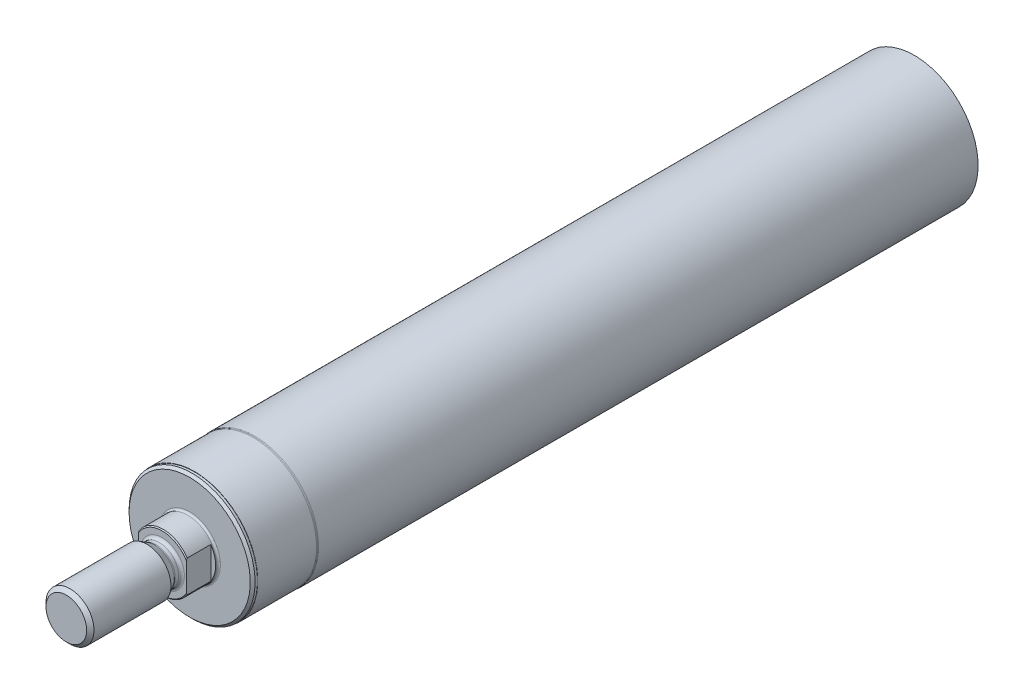
ISO-10303-21;
HEADER;
FILE_DESCRIPTION(('STEP AP214'),'2;1');
FILE_NAME('part.step','',(''),(''),'','','');
FILE_SCHEMA(('AUTOMOTIVE_DESIGN { 1 0 10303 214 1 1 1 1 }'));
ENDSEC;
DATA;
#1=APPLICATION_CONTEXT('core data for automotive mechanical design processes');
#2=APPLICATION_PROTOCOL_DEFINITION('international standard','automotive_design',2000,#1);
#3=PRODUCT_CONTEXT('',#1,'mechanical');
#4=PRODUCT('Part','Part','',(#3));
#5=PRODUCT_RELATED_PRODUCT_CATEGORY('part','',(#4));
#6=PRODUCT_DEFINITION_FORMATION('','',#4);
#7=PRODUCT_DEFINITION_CONTEXT('part definition',#1,'design');
#8=PRODUCT_DEFINITION('design','',#6,#7);
#9=PRODUCT_DEFINITION_SHAPE('','',#8);
#10=(LENGTH_UNIT() NAMED_UNIT(*) SI_UNIT(.MILLI.,.METRE.));
#11=(NAMED_UNIT(*) PLANE_ANGLE_UNIT() SI_UNIT($,.RADIAN.));
#12=(NAMED_UNIT(*) SI_UNIT($,.STERADIAN.) SOLID_ANGLE_UNIT());
#13=UNCERTAINTY_MEASURE_WITH_UNIT(LENGTH_MEASURE(1.E-05),#10,'distance_accuracy_value','');
#14=(GEOMETRIC_REPRESENTATION_CONTEXT(3) GLOBAL_UNCERTAINTY_ASSIGNED_CONTEXT((#13)) GLOBAL_UNIT_ASSIGNED_CONTEXT((#10,
#11,#12)) REPRESENTATION_CONTEXT('',''));
#15=CARTESIAN_POINT('',(0.,0.,0.));
#16=DIRECTION('',(0.,0.,1.));
#17=DIRECTION('',(1.,0.,0.));
#18=AXIS2_PLACEMENT_3D('',#15,#16,#17);
#19=CARTESIAN_POINT('',(0.,4.6,5.7));
#20=DIRECTION('',(0.,0.,-1.));
#21=DIRECTION('',(-1.,0.,0.));
#22=AXIS2_PLACEMENT_3D('',#19,#20,#21);
#23=PLANE('',#22);
#24=CARTESIAN_POINT('',(0.,0.,5.7));
#25=DIRECTION('',(0.,0.,-1.));
#26=DIRECTION('',(-0.862068965517242,0.506790981265484,0.));
#27=AXIS2_PLACEMENT_3D('',#24,#25,#26);
#28=CIRCLE('',#27,5.8);
#29=CARTESIAN_POINT('',(-5.,2.93938769133981,5.7));
#30=VERTEX_POINT('',#29);
#31=CARTESIAN_POINT('',(5.,2.93938769133981,5.7));
#32=VERTEX_POINT('',#31);
#33=EDGE_CURVE('E82',#30,#32,#28,.T.);
#34=ORIENTED_EDGE('',*,*,#33,.F.);
#35=DIRECTION('',(0.,-1.,0.));
#36=VECTOR('',#35,1.);
#37=CARTESIAN_POINT('',(-5.,2.93938769133981,5.7));
#38=LINE('',#37,#36);
#39=CARTESIAN_POINT('',(-5.,-2.93938769133981,5.7));
#40=VERTEX_POINT('',#39);
#41=EDGE_CURVE('E68',#30,#40,#38,.T.);
#42=ORIENTED_EDGE('',*,*,#41,.T.);
#43=CARTESIAN_POINT('',(0.,0.,5.7));
#44=DIRECTION('',(0.,0.,-1.));
#45=DIRECTION('',(0.862068965517242,-0.506790981265484,0.));
#46=AXIS2_PLACEMENT_3D('',#43,#44,#45);
#47=CIRCLE('',#46,5.8);
#48=CARTESIAN_POINT('',(5.,-2.93938769133981,5.7));
#49=VERTEX_POINT('',#48);
#50=EDGE_CURVE('E81',#49,#40,#47,.T.);
#51=ORIENTED_EDGE('',*,*,#50,.F.);
#52=DIRECTION('',(0.,1.,0.));
#53=VECTOR('',#52,1.);
#54=CARTESIAN_POINT('',(5.,-2.93938769133981,5.7));
#55=LINE('',#54,#53);
#56=EDGE_CURVE('E96',#49,#32,#55,.T.);
#57=ORIENTED_EDGE('',*,*,#56,.T.);
#58=EDGE_LOOP('',(#34,#42,#51,#57));
#59=FACE_BOUND('',#58,.T.);
#60=CARTESIAN_POINT('',(0.,0.,5.7));
#61=DIRECTION('',(0.,0.,-1.));
#62=DIRECTION('',(-1.,0.,0.));
#63=AXIS2_PLACEMENT_3D('',#60,#61,#62);
#64=CIRCLE('',#63,4.6000000000001);
#65=CARTESIAN_POINT('',(-4.6000000000001,0.,5.7));
#66=VERTEX_POINT('',#65);
#67=EDGE_CURVE('E107',#66,#66,#64,.T.);
#68=ORIENTED_EDGE('',*,*,#67,.T.);
#69=EDGE_LOOP('',(#68));
#70=FACE_BOUND('',#69,.T.);
#71=ADVANCED_FACE('F17',(#59,#70),#23,.F.);
#72=CARTESIAN_POINT('',(0.,0.,5.7));
#73=DIRECTION('',(0.,0.,-1.));
#74=DIRECTION('',(-1.,0.,0.));
#75=AXIS2_PLACEMENT_3D('',#72,#73,#74);
#76=CONICAL_SURFACE('',#75,5.8,0.785398163397452);
#77=CARTESIAN_POINT('',(5.,3.31662478956944,5.50000000043446));
#78=CARTESIAN_POINT('',(5.,3.25427711175451,5.53446397607247));
#79=CARTESIAN_POINT('',(5.,3.1915856170691,5.56844217320529));
#80=CARTESIAN_POINT('',(5.,3.06584448764966,5.63514178142565));
#81=CARTESIAN_POINT('',(5.,3.00280616011403,5.66786009062879));
#82=CARTESIAN_POINT('',(5.,2.93938785757019,5.69999991575594));
#83=B_SPLINE_CURVE_WITH_KNOTS('',3,(#77,#78,#79,#80,#81,#82),.UNSPECIFIED.,.F.,.F.,(4,2,4),
(0.00143435453377005,0.213523717826539,0.425613081119309),.UNSPECIFIED.);
#84=CARTESIAN_POINT('',(5.,3.3166247903554,5.5));
#85=VERTEX_POINT('',#84);
#86=EDGE_CURVE('E112',#85,#32,#83,.T.);
#87=ORIENTED_EDGE('',*,*,#86,.F.);
#88=CARTESIAN_POINT('',(0.,0.,5.5));
#89=DIRECTION('',(0.,0.,-1.));
#90=DIRECTION('',(-0.833333333333333,0.552770798392567,0.));
#91=AXIS2_PLACEMENT_3D('',#88,#89,#90);
#92=CIRCLE('',#91,6.);
#93=CARTESIAN_POINT('',(-5.,3.3166247903554,5.5));
#94=VERTEX_POINT('',#93);
#95=EDGE_CURVE('E90',#94,#85,#92,.T.);
#96=ORIENTED_EDGE('',*,*,#95,.F.);
#97=CARTESIAN_POINT('',(-5.,2.93938770041416,5.69999999540121));
#98=CARTESIAN_POINT('',(-5.,3.00286749939616,5.66782900571077));
#99=CARTESIAN_POINT('',(-5.,3.06602758010427,5.63504605587609));
#100=CARTESIAN_POINT('',(-5.,3.19176760401688,5.5683442376697));
#101=CARTESIAN_POINT('',(-5.,3.25433739747104,5.53443065189444));
#102=CARTESIAN_POINT('',(-5.,3.31662479034987,5.50000000000306));
#103=B_SPLINE_CURVE_WITH_KNOTS('',3,(#97,#98,#99,#100,#101,#102),.UNSPECIFIED.,.F.,.F.,(4,2,4),
(6.54939197142909,6.76083639674114,6.97228082205318),.UNSPECIFIED.);
#104=EDGE_CURVE('E72',#30,#94,#103,.T.);
#105=ORIENTED_EDGE('',*,*,#104,.F.);
#106=ORIENTED_EDGE('',*,*,#33,.T.);
#107=EDGE_LOOP('',(#87,#96,#105,#106));
#108=FACE_BOUND('',#107,.T.);
#109=ADVANCED_FACE('F89',(#108),#76,.T.);
#110=CARTESIAN_POINT('',(-5.,7.,0.6));
#111=DIRECTION('',(-1.,0.,0.));
#112=DIRECTION('',(0.,0.,1.));
#113=AXIS2_PLACEMENT_3D('',#110,#111,#112);
#114=PLANE('',#113);
#115=ORIENTED_EDGE('',*,*,#104,.T.);
#116=DIRECTION('',(0.,0.,-1.));
#117=VECTOR('',#116,1.);
#118=CARTESIAN_POINT('',(-5.,3.3166247903554,5.5));
#119=LINE('',#118,#117);
#120=CARTESIAN_POINT('',(-5.,3.3166247903554,0.6));
#121=VERTEX_POINT('',#120);
#122=EDGE_CURVE('E91',#94,#121,#119,.T.);
#123=ORIENTED_EDGE('',*,*,#122,.T.);
#124=DIRECTION('',(0.,-1.,0.));
#125=VECTOR('',#124,1.);
#126=CARTESIAN_POINT('',(-5.,3.3166247903554,0.6));
#127=LINE('',#126,#125);
#128=CARTESIAN_POINT('',(-5.,-3.3166247903554,0.6));
#129=VERTEX_POINT('',#128);
#130=EDGE_CURVE('E646',#121,#129,#127,.T.);
#131=ORIENTED_EDGE('',*,*,#130,.T.);
#132=DIRECTION('',(0.,0.,1.));
#133=VECTOR('',#132,1.);
#134=CARTESIAN_POINT('',(-5.,-3.3166247903554,0.600000000000001));
#135=LINE('',#134,#133);
#136=CARTESIAN_POINT('',(-5.,-3.3166247903554,5.5));
#137=VERTEX_POINT('',#136);
#138=EDGE_CURVE('E648',#129,#137,#135,.T.);
#139=ORIENTED_EDGE('',*,*,#138,.T.);
#140=CARTESIAN_POINT('',(-5.,-3.31662478956943,5.50000000043446));
#141=CARTESIAN_POINT('',(-5.,-3.25427711175451,5.53446397607247));
#142=CARTESIAN_POINT('',(-5.,-3.1915856170691,5.56844217320529));
#143=CARTESIAN_POINT('',(-5.,-3.06584448764966,5.63514178142565));
#144=CARTESIAN_POINT('',(-5.,-3.00280616011403,5.66786009062879));
#145=CARTESIAN_POINT('',(-5.,-2.93938785757019,5.69999991575594));
#146=B_SPLINE_CURVE_WITH_KNOTS('',3,(#140,#141,#142,#143,#144,#145),.UNSPECIFIED.,.F.,.F.,(4,2,
4),(0.00143435453377005,0.21352371782654,0.42561308111931),.UNSPECIFIED.);
#147=EDGE_CURVE('E76',#137,#40,#146,.T.);
#148=ORIENTED_EDGE('',*,*,#147,.T.);
#149=ORIENTED_EDGE('',*,*,#41,.F.);
#150=EDGE_LOOP('',(#115,#123,#131,#139,#148,#149));
#151=FACE_BOUND('',#150,.T.);
#152=ADVANCED_FACE('F70',(#151),#114,.T.);
#153=ORIENTED_EDGE('',*,*,#147,.F.);
#154=CARTESIAN_POINT('',(0.,0.,5.5));
#155=DIRECTION('',(0.,0.,-1.));
#156=DIRECTION('',(0.833333333333333,-0.552770798392567,0.));
#157=AXIS2_PLACEMENT_3D('',#154,#155,#156);
#158=CIRCLE('',#157,6.);
#159=CARTESIAN_POINT('',(5.,-3.3166247903554,5.5));
#160=VERTEX_POINT('',#159);
#161=EDGE_CURVE('E144',#160,#137,#158,.T.);
#162=ORIENTED_EDGE('',*,*,#161,.F.);
#163=CARTESIAN_POINT('',(5.,-2.93938770041415,5.69999999540121));
#164=CARTESIAN_POINT('',(5.,-3.00286749939616,5.66782900571077));
#165=CARTESIAN_POINT('',(5.,-3.06602758010427,5.63504605587608));
#166=CARTESIAN_POINT('',(5.,-3.19176760401688,5.5683442376697));
#167=CARTESIAN_POINT('',(5.,-3.25433739747104,5.53443065189444));
#168=CARTESIAN_POINT('',(5.,-3.31662479034986,5.50000000000306));
#169=B_SPLINE_CURVE_WITH_KNOTS('',3,(#163,#164,#165,#166,#167,#168),.UNSPECIFIED.,.F.,.F.,(4,2,
4),(6.54939197142909,6.76083639674114,6.97228082205318),.UNSPECIFIED.);
#170=EDGE_CURVE('E151',#49,#160,#169,.T.);
#171=ORIENTED_EDGE('',*,*,#170,.F.);
#172=ORIENTED_EDGE('',*,*,#50,.T.);
#173=EDGE_LOOP('',(#153,#162,#171,#172));
#174=FACE_BOUND('',#173,.T.);
#175=ADVANCED_FACE('F127',(#174),#76,.T.);
#176=CARTESIAN_POINT('',(5.,-7.,0.6));
#177=DIRECTION('',(1.,0.,0.));
#178=DIRECTION('',(0.,0.,-1.));
#179=AXIS2_PLACEMENT_3D('',#176,#177,#178);
#180=PLANE('',#179);
#181=ORIENTED_EDGE('',*,*,#170,.T.);
#182=DIRECTION('',(0.,0.,-1.));
#183=VECTOR('',#182,1.);
#184=CARTESIAN_POINT('',(5.,-3.3166247903554,5.5));
#185=LINE('',#184,#183);
#186=CARTESIAN_POINT('',(5.,-3.3166247903554,0.6));
#187=VERTEX_POINT('',#186);
#188=EDGE_CURVE('E159',#160,#187,#185,.T.);
#189=ORIENTED_EDGE('',*,*,#188,.T.);
#190=DIRECTION('',(0.,1.,0.));
#191=VECTOR('',#190,1.);
#192=CARTESIAN_POINT('',(5.,-3.3166247903554,0.6));
#193=LINE('',#192,#191);
#194=CARTESIAN_POINT('',(5.,3.3166247903554,0.6));
#195=VERTEX_POINT('',#194);
#196=EDGE_CURVE('E34',#187,#195,#193,.T.);
#197=ORIENTED_EDGE('',*,*,#196,.T.);
#198=DIRECTION('',(0.,0.,1.));
#199=VECTOR('',#198,1.);
#200=CARTESIAN_POINT('',(5.,3.3166247903554,0.600000000000001));
#201=LINE('',#200,#199);
#202=EDGE_CURVE('E161',#195,#85,#201,.T.);
#203=ORIENTED_EDGE('',*,*,#202,.T.);
#204=ORIENTED_EDGE('',*,*,#86,.T.);
#205=ORIENTED_EDGE('',*,*,#56,.F.);
#206=EDGE_LOOP('',(#181,#189,#197,#203,#204,#205));
#207=FACE_BOUND('',#206,.T.);
#208=ADVANCED_FACE('F181',(#207),#180,.T.);
#209=CARTESIAN_POINT('',(0.,0.,6.3000000000001));
#210=DIRECTION('',(0.,0.,-1.));
#211=DIRECTION('',(-1.,0.,0.));
#212=AXIS2_PLACEMENT_3D('',#209,#210,#211);
#213=TOROIDAL_SURFACE('',#212,4.6000000000001,0.600000000000097);
#214=ORIENTED_EDGE('',*,*,#67,.F.);
#215=EDGE_LOOP('',(#214));
#216=FACE_BOUND('',#215,.T.);
#217=CARTESIAN_POINT('',(0.,0.,6.3));
#218=DIRECTION('',(0.,0.,-1.));
#219=DIRECTION('',(-1.,0.,0.));
#220=AXIS2_PLACEMENT_3D('',#217,#218,#219);
#221=CIRCLE('',#220,4.);
#222=CARTESIAN_POINT('',(-4.,0.,6.3));
#223=VERTEX_POINT('',#222);
#224=EDGE_CURVE('E173',#223,#223,#221,.T.);
#225=ORIENTED_EDGE('',*,*,#224,.T.);
#226=EDGE_LOOP('',(#225));
#227=FACE_BOUND('',#226,.T.);
#228=ADVANCED_FACE('F190',(#216,#227),#213,.F.);
#229=CARTESIAN_POINT('',(0.,0.,-36.));
#230=DIRECTION('',(0.,0.,-1.));
#231=DIRECTION('',(-1.,0.,0.));
#232=AXIS2_PLACEMENT_3D('',#229,#230,#231);
#233=CYLINDRICAL_SURFACE('',#232,6.);
#234=CARTESIAN_POINT('',(0.,0.,0.4));
#235=DIRECTION('',(0.,0.,-1.));
#236=DIRECTION('',(-1.,0.,0.));
#237=AXIS2_PLACEMENT_3D('',#234,#235,#236);
#238=CIRCLE('',#237,6.);
#239=CARTESIAN_POINT('',(-6.,0.,0.4));
#240=VERTEX_POINT('',#239);
#241=EDGE_CURVE('E624',#240,#240,#238,.T.);
#242=ORIENTED_EDGE('',*,*,#241,.F.);
#243=EDGE_LOOP('',(#242));
#244=FACE_BOUND('',#243,.T.);
#245=ORIENTED_EDGE('',*,*,#122,.F.);
#246=ORIENTED_EDGE('',*,*,#95,.T.);
#247=ORIENTED_EDGE('',*,*,#202,.F.);
#248=CARTESIAN_POINT('',(0.,0.,0.600000000000001));
#249=DIRECTION('',(0.,0.,1.));
#250=DIRECTION('',(0.833333333333333,-0.552770798392567,0.));
#251=AXIS2_PLACEMENT_3D('',#248,#249,#250);
#252=CIRCLE('',#251,6.);
#253=EDGE_CURVE('E31',#187,#195,#252,.T.);
#254=ORIENTED_EDGE('',*,*,#253,.F.);
#255=ORIENTED_EDGE('',*,*,#188,.F.);
#256=ORIENTED_EDGE('',*,*,#161,.T.);
#257=ORIENTED_EDGE('',*,*,#138,.F.);
#258=CARTESIAN_POINT('',(0.,0.,0.600000000000001));
#259=DIRECTION('',(0.,0.,1.));
#260=DIRECTION('',(-0.833333333333333,0.552770798392567,0.));
#261=AXIS2_PLACEMENT_3D('',#258,#259,#260);
#262=CIRCLE('',#261,6.);
#263=EDGE_CURVE('E618',#121,#129,#262,.T.);
#264=ORIENTED_EDGE('',*,*,#263,.F.);
#265=EDGE_LOOP('',(#245,#246,#247,#254,#255,#256,#257,#264));
#266=FACE_BOUND('',#265,.T.);
#267=ADVANCED_FACE('F194',(#244,#266),#233,.T.);
#268=CARTESIAN_POINT('',(0.,0.,0.6));
#269=DIRECTION('',(0.,0.,1.));
#270=DIRECTION('',(1.,0.,0.));
#271=AXIS2_PLACEMENT_3D('',#268,#269,#270);
#272=PLANE('',#271);
#273=ORIENTED_EDGE('',*,*,#263,.T.);
#274=ORIENTED_EDGE('',*,*,#130,.F.);
#275=EDGE_LOOP('',(#273,#274));
#276=FACE_BOUND('',#275,.T.);
#277=ADVANCED_FACE('F198',(#276),#272,.T.);
#278=ORIENTED_EDGE('',*,*,#253,.T.);
#279=ORIENTED_EDGE('',*,*,#196,.F.);
#280=EDGE_LOOP('',(#278,#279));
#281=FACE_BOUND('',#280,.T.);
#282=ADVANCED_FACE('F202',(#281),#272,.T.);
#283=CARTESIAN_POINT('',(0.,0.,-36.));
#284=DIRECTION('',(0.,0.,-1.));
#285=DIRECTION('',(-1.,0.,0.));
#286=AXIS2_PLACEMENT_3D('',#283,#284,#285);
#287=CYLINDRICAL_SURFACE('',#286,4.);
#288=ORIENTED_EDGE('',*,*,#224,.F.);
#289=EDGE_LOOP('',(#288));
#290=FACE_BOUND('',#289,.T.);
#291=CARTESIAN_POINT('',(0.,0.,7.0071796769725));
#292=DIRECTION('',(0.,0.,-1.));
#293=DIRECTION('',(-1.,0.,0.));
#294=AXIS2_PLACEMENT_3D('',#291,#292,#293);
#295=CIRCLE('',#294,4.);
#296=CARTESIAN_POINT('',(-4.,0.,7.0071796769725));
#297=VERTEX_POINT('',#296);
#298=EDGE_CURVE('E615',#297,#297,#295,.T.);
#299=ORIENTED_EDGE('',*,*,#298,.T.);
#300=EDGE_LOOP('',(#299));
#301=FACE_BOUND('',#300,.T.);
#302=ADVANCED_FACE('F204',(#290,#301),#287,.T.);
#303=CARTESIAN_POINT('',(0.,0.,0.40000000000003));
#304=DIRECTION('',(0.,0.,-1.));
#305=DIRECTION('',(-1.,0.,0.));
#306=AXIS2_PLACEMENT_3D('',#303,#304,#305);
#307=TOROIDAL_SURFACE('',#306,6.4,0.40000000000003);
#308=CARTESIAN_POINT('',(0.,0.,0.));
#309=DIRECTION('',(0.,0.,-1.));
#310=DIRECTION('',(-1.,0.,0.));
#311=AXIS2_PLACEMENT_3D('',#308,#309,#310);
#312=CIRCLE('',#311,6.4);
#313=CARTESIAN_POINT('',(-6.4,0.,0.));
#314=VERTEX_POINT('',#313);
#315=EDGE_CURVE('E612',#314,#314,#312,.T.);
#316=ORIENTED_EDGE('',*,*,#315,.F.);
#317=EDGE_LOOP('',(#316));
#318=FACE_BOUND('',#317,.T.);
#319=ORIENTED_EDGE('',*,*,#241,.T.);
#320=EDGE_LOOP('',(#319));
#321=FACE_BOUND('',#320,.T.);
#322=ADVANCED_FACE('F207',(#318,#321),#307,.F.);
#323=CARTESIAN_POINT('',(0.,0.,7.00717967697211));
#324=DIRECTION('',(0.,0.,-1.));
#325=DIRECTION('',(-1.,0.,0.));
#326=AXIS2_PLACEMENT_3D('',#323,#324,#325);
#327=TOROIDAL_SURFACE('',#326,4.60000000000168,0.600000000001679);
#328=ORIENTED_EDGE('',*,*,#298,.F.);
#329=EDGE_LOOP('',(#328));
#330=FACE_BOUND('',#329,.T.);
#331=CARTESIAN_POINT('',(0.,0.,7.3071796769725));
#332=DIRECTION('',(0.,0.,-1.));
#333=DIRECTION('',(-1.,0.,0.));
#334=AXIS2_PLACEMENT_3D('',#331,#332,#333);
#335=CIRCLE('',#334,4.0803847577293);
#336=CARTESIAN_POINT('',(-4.0803847577293,0.,7.3071796769725));
#337=VERTEX_POINT('',#336);
#338=EDGE_CURVE('E609',#337,#337,#335,.T.);
#339=ORIENTED_EDGE('',*,*,#338,.T.);
#340=EDGE_LOOP('',(#339));
#341=FACE_BOUND('',#340,.T.);
#342=ADVANCED_FACE('F211',(#330,#341),#327,.F.);
#343=CARTESIAN_POINT('',(0.,6.4,0.));
#344=DIRECTION('',(0.,0.,-1.));
#345=DIRECTION('',(-1.,0.,0.));
#346=AXIS2_PLACEMENT_3D('',#343,#344,#345);
#347=PLANE('',#346);
#348=CARTESIAN_POINT('',(0.,0.,0.));
#349=DIRECTION('',(0.,0.,-1.));
#350=DIRECTION('',(-1.,0.,0.));
#351=AXIS2_PLACEMENT_3D('',#348,#349,#350);
#352=CIRCLE('',#351,12.625);
#353=CARTESIAN_POINT('',(-12.625,0.,0.));
#354=VERTEX_POINT('',#353);
#355=EDGE_CURVE('E606',#354,#354,#352,.T.);
#356=ORIENTED_EDGE('',*,*,#355,.F.);
#357=EDGE_LOOP('',(#356));
#358=FACE_BOUND('',#357,.T.);
#359=ORIENTED_EDGE('',*,*,#315,.T.);
#360=EDGE_LOOP('',(#359));
#361=FACE_BOUND('',#360,.T.);
#362=ADVANCED_FACE('F215',(#358,#361),#347,.F.);
#363=CARTESIAN_POINT('',(0.,0.,8.9));
#364=DIRECTION('',(0.,0.,1.));
#365=DIRECTION('',(1.,0.,0.));
#366=AXIS2_PLACEMENT_3D('',#363,#364,#365);
#367=CONICAL_SURFACE('',#366,5.,0.523598775598328);
#368=ORIENTED_EDGE('',*,*,#338,.F.);
#369=EDGE_LOOP('',(#368));
#370=FACE_BOUND('',#369,.T.);
#371=CARTESIAN_POINT('',(0.,0.,8.9));
#372=DIRECTION('',(0.,0.,-1.));
#373=DIRECTION('',(-1.,0.,0.));
#374=AXIS2_PLACEMENT_3D('',#371,#372,#373);
#375=CIRCLE('',#374,5.);
#376=CARTESIAN_POINT('',(-5.,0.,8.9));
#377=VERTEX_POINT('',#376);
#378=EDGE_CURVE('E603',#377,#377,#375,.T.);
#379=ORIENTED_EDGE('',*,*,#378,.T.);
#380=EDGE_LOOP('',(#379));
#381=FACE_BOUND('',#380,.T.);
#382=ADVANCED_FACE('F219',(#370,#381),#367,.T.);
#383=CARTESIAN_POINT('',(0.,0.,0.));
#384=DIRECTION('',(0.,0.,-1.));
#385=DIRECTION('',(-1.,0.,0.));
#386=AXIS2_PLACEMENT_3D('',#383,#384,#385);
#387=CONICAL_SURFACE('',#386,12.625,0.785398163397446);
#388=CARTESIAN_POINT('',(0.,0.,-0.5));
#389=DIRECTION('',(0.,0.,-1.));
#390=DIRECTION('',(-1.,0.,0.));
#391=AXIS2_PLACEMENT_3D('',#388,#389,#390);
#392=CIRCLE('',#391,13.125);
#393=CARTESIAN_POINT('',(-13.125,0.,-0.5));
#394=VERTEX_POINT('',#393);
#395=EDGE_CURVE('E600',#394,#394,#392,.T.);
#396=ORIENTED_EDGE('',*,*,#395,.F.);
#397=EDGE_LOOP('',(#396));
#398=FACE_BOUND('',#397,.T.);
#399=ORIENTED_EDGE('',*,*,#355,.T.);
#400=EDGE_LOOP('',(#399));
#401=FACE_BOUND('',#400,.T.);
#402=ADVANCED_FACE('F223',(#398,#401),#387,.T.);
#403=CARTESIAN_POINT('',(0.,0.,-36.));
#404=DIRECTION('',(0.,0.,-1.));
#405=DIRECTION('',(-1.,0.,0.));
#406=AXIS2_PLACEMENT_3D('',#403,#404,#405);
#407=CYLINDRICAL_SURFACE('',#406,5.);
#408=ORIENTED_EDGE('',*,*,#378,.F.);
#409=EDGE_LOOP('',(#408));
#410=FACE_BOUND('',#409,.T.);
#411=CARTESIAN_POINT('',(0.,0.,24.933));
#412=DIRECTION('',(0.,0.,-1.));
#413=DIRECTION('',(-1.,0.,0.));
#414=AXIS2_PLACEMENT_3D('',#411,#412,#413);
#415=CIRCLE('',#414,5.);
#416=CARTESIAN_POINT('',(-5.,0.,24.933));
#417=VERTEX_POINT('',#416);
#418=EDGE_CURVE('E597',#417,#417,#415,.T.);
#419=ORIENTED_EDGE('',*,*,#418,.T.);
#420=EDGE_LOOP('',(#419));
#421=FACE_BOUND('',#420,.T.);
#422=ADVANCED_FACE('F227',(#410,#421),#407,.T.);
#423=CARTESIAN_POINT('',(0.,0.,-36.));
#424=DIRECTION('',(0.,0.,-1.));
#425=DIRECTION('',(-1.,0.,0.));
#426=AXIS2_PLACEMENT_3D('',#423,#424,#425);
#427=CYLINDRICAL_SURFACE('',#426,13.125);
#428=CARTESIAN_POINT('',(0.,0.,-1.));
#429=DIRECTION('',(0.,0.,-1.));
#430=DIRECTION('',(-1.,0.,0.));
#431=AXIS2_PLACEMENT_3D('',#428,#429,#430);
#432=CIRCLE('',#431,13.125);
#433=CARTESIAN_POINT('',(-13.125,0.,-1.));
#434=VERTEX_POINT('',#433);
#435=EDGE_CURVE('E594',#434,#434,#432,.T.);
#436=ORIENTED_EDGE('',*,*,#435,.F.);
#437=EDGE_LOOP('',(#436));
#438=FACE_BOUND('',#437,.T.);
#439=ORIENTED_EDGE('',*,*,#395,.T.);
#440=EDGE_LOOP('',(#439));
#441=FACE_BOUND('',#440,.T.);
#442=ADVANCED_FACE('F231',(#438,#441),#427,.T.);
#443=CARTESIAN_POINT('',(0.,0.,25.7));
#444=DIRECTION('',(0.,0.,-1.));
#445=DIRECTION('',(-1.,0.,0.));
#446=AXIS2_PLACEMENT_3D('',#443,#444,#445);
#447=CONICAL_SURFACE('',#446,4.233,0.785398163397446);
#448=ORIENTED_EDGE('',*,*,#418,.F.);
#449=EDGE_LOOP('',(#448));
#450=FACE_BOUND('',#449,.T.);
#451=CARTESIAN_POINT('',(0.,0.,25.7));
#452=DIRECTION('',(0.,0.,-1.));
#453=DIRECTION('',(-1.,0.,0.));
#454=AXIS2_PLACEMENT_3D('',#451,#452,#453);
#455=CIRCLE('',#454,4.233);
#456=CARTESIAN_POINT('',(-4.233,0.,25.7));
#457=VERTEX_POINT('',#456);
#458=EDGE_CURVE('E591',#457,#457,#455,.T.);
#459=ORIENTED_EDGE('',*,*,#458,.T.);
#460=EDGE_LOOP('',(#459));
#461=FACE_BOUND('',#460,.T.);
#462=ADVANCED_FACE('F235',(#450,#461),#447,.T.);
#463=CARTESIAN_POINT('',(0.,13.125,-1.));
#464=DIRECTION('',(0.,0.,-1.));
#465=DIRECTION('',(-1.,0.,0.));
#466=AXIS2_PLACEMENT_3D('',#463,#464,#465);
#467=PLANE('',#466);
#468=CARTESIAN_POINT('',(0.,0.,-1.));
#469=DIRECTION('',(0.,0.,-1.));
#470=DIRECTION('',(-1.,0.,0.));
#471=AXIS2_PLACEMENT_3D('',#468,#469,#470);
#472=CIRCLE('',#471,13.185);
#473=CARTESIAN_POINT('',(-13.185,0.,-1.));
#474=VERTEX_POINT('',#473);
#475=EDGE_CURVE('E588',#474,#474,#472,.T.);
#476=ORIENTED_EDGE('',*,*,#475,.F.);
#477=EDGE_LOOP('',(#476));
#478=FACE_BOUND('',#477,.T.);
#479=ORIENTED_EDGE('',*,*,#435,.T.);
#480=EDGE_LOOP('',(#479));
#481=FACE_BOUND('',#480,.T.);
#482=ADVANCED_FACE('F239',(#478,#481),#467,.F.);
#483=CARTESIAN_POINT('',(0.,0.,25.7));
#484=DIRECTION('',(0.,0.,-1.));
#485=DIRECTION('',(-1.,0.,0.));
#486=AXIS2_PLACEMENT_3D('',#483,#484,#485);
#487=PLANE('',#486);
#488=ORIENTED_EDGE('',*,*,#458,.F.);
#489=EDGE_LOOP('',(#488));
#490=FACE_BOUND('',#489,.T.);
#491=ADVANCED_FACE('F243',(#490),#487,.F.);
#492=CARTESIAN_POINT('',(0.,0.,-36.));
#493=DIRECTION('',(0.,0.,-1.));
#494=DIRECTION('',(-1.,0.,0.));
#495=AXIS2_PLACEMENT_3D('',#492,#493,#494);
#496=CYLINDRICAL_SURFACE('',#495,13.185);
#497=CARTESIAN_POINT('',(0.,0.,-13.250903109113));
#498=DIRECTION('',(0.,0.,-1.));
#499=DIRECTION('',(-1.,0.,0.));
#500=AXIS2_PLACEMENT_3D('',#497,#498,#499);
#501=CIRCLE('',#500,13.185);
#502=CARTESIAN_POINT('',(-13.185,0.,-13.250903109113));
#503=VERTEX_POINT('',#502);
#504=EDGE_CURVE('E585',#503,#503,#501,.T.);
#505=ORIENTED_EDGE('',*,*,#504,.F.);
#506=EDGE_LOOP('',(#505));
#507=FACE_BOUND('',#506,.T.);
#508=ORIENTED_EDGE('',*,*,#475,.T.);
#509=EDGE_LOOP('',(#508));
#510=FACE_BOUND('',#509,.T.);
#511=ADVANCED_FACE('F247',(#507,#510),#496,.T.);
#512=CARTESIAN_POINT('',(0.,0.,-13.2509031342658));
#513=DIRECTION('',(0.,0.,-1.));
#514=DIRECTION('',(-1.,0.,0.));
#515=AXIS2_PLACEMENT_3D('',#512,#513,#514);
#516=TOROIDAL_SURFACE('',#515,13.5850000000193,0.400000000019289);
#517=CARTESIAN_POINT('',(0.,0.,-13.419999981509));
#518=DIRECTION('',(0.,0.,-1.));
#519=DIRECTION('',(-1.,0.,0.));
#520=AXIS2_PLACEMENT_3D('',#517,#518,#519);
#521=CIRCLE('',#520,13.222499991374);
#522=CARTESIAN_POINT('',(-13.222499991374,0.,-13.419999981509));
#523=VERTEX_POINT('',#522);
#524=EDGE_CURVE('E582',#523,#523,#521,.T.);
#525=ORIENTED_EDGE('',*,*,#524,.F.);
#526=EDGE_LOOP('',(#525));
#527=FACE_BOUND('',#526,.T.);
#528=ORIENTED_EDGE('',*,*,#504,.T.);
#529=EDGE_LOOP('',(#528));
#530=FACE_BOUND('',#529,.T.);
#531=ADVANCED_FACE('F251',(#527,#530),#516,.F.);
#532=CARTESIAN_POINT('',(0.,0.,-13.5890968657324));
#533=DIRECTION('',(0.,0.,-1.));
#534=DIRECTION('',(-1.,0.,0.));
#535=AXIS2_PLACEMENT_3D('',#532,#533,#534);
#536=TOROIDAL_SURFACE('',#535,12.859999999997,0.400000000002999);
#537=ORIENTED_EDGE('',*,*,#524,.T.);
#538=EDGE_LOOP('',(#537));
#539=FACE_BOUND('',#538,.T.);
#540=CARTESIAN_POINT('',(0.,0.,-13.589096890887));
#541=DIRECTION('',(0.,0.,-1.));
#542=DIRECTION('',(-1.,0.,0.));
#543=AXIS2_PLACEMENT_3D('',#540,#541,#542);
#544=CIRCLE('',#543,13.26);
#545=CARTESIAN_POINT('',(-13.26,0.,-13.589096890887));
#546=VERTEX_POINT('',#545);
#547=EDGE_CURVE('E579',#546,#546,#544,.T.);
#548=ORIENTED_EDGE('',*,*,#547,.F.);
#549=EDGE_LOOP('',(#548));
#550=FACE_BOUND('',#549,.T.);
#551=ADVANCED_FACE('F255',(#539,#550),#536,.T.);
#552=CARTESIAN_POINT('',(0.,0.,-36.));
#553=DIRECTION('',(0.,0.,-1.));
#554=DIRECTION('',(-1.,0.,0.));
#555=AXIS2_PLACEMENT_3D('',#552,#553,#554);
#556=CYLINDRICAL_SURFACE('',#555,13.26);
#557=CARTESIAN_POINT('',(0.,0.,-151.));
#558=DIRECTION('',(0.,0.,-1.));
#559=DIRECTION('',(-1.,0.,0.));
#560=AXIS2_PLACEMENT_3D('',#557,#558,#559);
#561=CIRCLE('',#560,13.26);
#562=CARTESIAN_POINT('',(-13.26,0.,-151.));
#563=VERTEX_POINT('',#562);
#564=EDGE_CURVE('E576',#563,#563,#561,.T.);
#565=ORIENTED_EDGE('',*,*,#564,.F.);
#566=EDGE_LOOP('',(#565));
#567=FACE_BOUND('',#566,.T.);
#568=ORIENTED_EDGE('',*,*,#547,.T.);
#569=EDGE_LOOP('',(#568));
#570=FACE_BOUND('',#569,.T.);
#571=ADVANCED_FACE('F259',(#567,#570),#556,.T.);
#572=CARTESIAN_POINT('',(0.,13.26,-151.));
#573=DIRECTION('',(0.,0.,1.));
#574=DIRECTION('',(1.,0.,0.));
#575=AXIS2_PLACEMENT_3D('',#572,#573,#574);
#576=PLANE('',#575);
#577=CARTESIAN_POINT('',(0.,0.,-151.));
#578=DIRECTION('',(0.,0.,-1.));
#579=DIRECTION('',(-1.,0.,0.));
#580=AXIS2_PLACEMENT_3D('',#577,#578,#579);
#581=CIRCLE('',#580,3.315);
#582=CARTESIAN_POINT('',(-3.315,0.,-151.));
#583=VERTEX_POINT('',#582);
#584=EDGE_CURVE('E571',#583,#583,#581,.T.);
#585=ORIENTED_EDGE('',*,*,#584,.F.);
#586=EDGE_LOOP('',(#585));
#587=FACE_BOUND('',#586,.T.);
#588=ORIENTED_EDGE('',*,*,#564,.T.);
#589=EDGE_LOOP('',(#588));
#590=FACE_BOUND('',#589,.T.);
#591=ADVANCED_FACE('F263',(#587,#590),#576,.F.);
#592=CARTESIAN_POINT('',(0.,0.,-36.));
#593=DIRECTION('',(0.,0.,-1.));
#594=DIRECTION('',(-1.,0.,0.));
#595=AXIS2_PLACEMENT_3D('',#592,#593,#594);
#596=CYLINDRICAL_SURFACE('',#595,3.315);
#597=CARTESIAN_POINT('',(0.,0.,-141.));
#598=DIRECTION('',(0.,0.,-1.));
#599=DIRECTION('',(-1.,0.,0.));
#600=AXIS2_PLACEMENT_3D('',#597,#598,#599);
#601=CIRCLE('',#600,3.315);
#602=CARTESIAN_POINT('',(-3.315,0.,-141.));
#603=VERTEX_POINT('',#602);
#604=EDGE_CURVE('E569',#603,#603,#601,.T.);
#605=ORIENTED_EDGE('',*,*,#604,.F.);
#606=EDGE_LOOP('',(#605));
#607=FACE_BOUND('',#606,.T.);
#608=ORIENTED_EDGE('',*,*,#584,.T.);
#609=EDGE_LOOP('',(#608));
#610=FACE_BOUND('',#609,.T.);
#611=ADVANCED_FACE('F267',(#607,#610),#596,.F.);
#612=CARTESIAN_POINT('',(0.,3.315,-141.));
#613=DIRECTION('',(0.,0.,-1.));
#614=DIRECTION('',(-1.,0.,0.));
#615=AXIS2_PLACEMENT_3D('',#612,#613,#614);
#616=PLANE('',#615);
#617=CARTESIAN_POINT('',(0.,0.,-141.));
#618=DIRECTION('',(0.,0.,-1.));
#619=DIRECTION('',(-1.,0.,0.));
#620=AXIS2_PLACEMENT_3D('',#617,#618,#619);
#621=CIRCLE('',#620,6.63);
#622=CARTESIAN_POINT('',(-6.63,0.,-141.));
#623=VERTEX_POINT('',#622);
#624=EDGE_CURVE('E25',#623,#623,#621,.T.);
#625=ORIENTED_EDGE('',*,*,#624,.F.);
#626=EDGE_LOOP('',(#625));
#627=FACE_BOUND('',#626,.T.);
#628=ORIENTED_EDGE('',*,*,#604,.T.);
#629=EDGE_LOOP('',(#628));
#630=FACE_BOUND('',#629,.T.);
#631=ADVANCED_FACE('F271',(#627,#630),#616,.F.);
#632=CARTESIAN_POINT('',(0.,0.,-36.));
#633=DIRECTION('',(0.,0.,-1.));
#634=DIRECTION('',(-1.,0.,0.));
#635=AXIS2_PLACEMENT_3D('',#632,#633,#634);
#636=CYLINDRICAL_SURFACE('',#635,6.63);
#637=CARTESIAN_POINT('',(0.,0.,-36.));
#638=DIRECTION('',(0.,0.,-1.));
#639=DIRECTION('',(-1.,0.,0.));
#640=AXIS2_PLACEMENT_3D('',#637,#638,#639);
#641=CIRCLE('',#640,6.63);
#642=CARTESIAN_POINT('',(-6.63,0.,-36.));
#643=VERTEX_POINT('',#642);
#644=EDGE_CURVE('E11',#643,#643,#641,.T.);
#645=ORIENTED_EDGE('',*,*,#644,.F.);
#646=EDGE_LOOP('',(#645));
#647=FACE_BOUND('',#646,.T.);
#648=ORIENTED_EDGE('',*,*,#624,.T.);
#649=EDGE_LOOP('',(#648));
#650=FACE_BOUND('',#649,.T.);
#651=ADVANCED_FACE('F274',(#647,#650),#636,.F.);
#652=CARTESIAN_POINT('',(0.,6.63,-36.));
#653=DIRECTION('',(0.,0.,1.));
#654=DIRECTION('',(1.,0.,0.));
#655=AXIS2_PLACEMENT_3D('',#652,#653,#654);
#656=PLANE('',#655);
#657=ORIENTED_EDGE('',*,*,#644,.T.);
#658=EDGE_LOOP('',(#657));
#659=FACE_BOUND('',#658,.T.);
#660=ADVANCED_FACE('F19',(#659),#656,.F.);
#661=CLOSED_SHELL('',(#71,#109,#152,#175,#208,#228,#267,#277,#282,#302,#322,#342,#362,#382,#402,
#422,#442,#462,#482,#491,#511,#531,#551,#571,#591,#611,#631,#651,#660));
#662=MANIFOLD_SOLID_BREP('B1',#661);
#663=ADVANCED_BREP_SHAPE_REPRESENTATION('',(#18,#662),#14);
#664=SHAPE_DEFINITION_REPRESENTATION(#9,#663);
ENDSEC;
END-ISO-10303-21;
